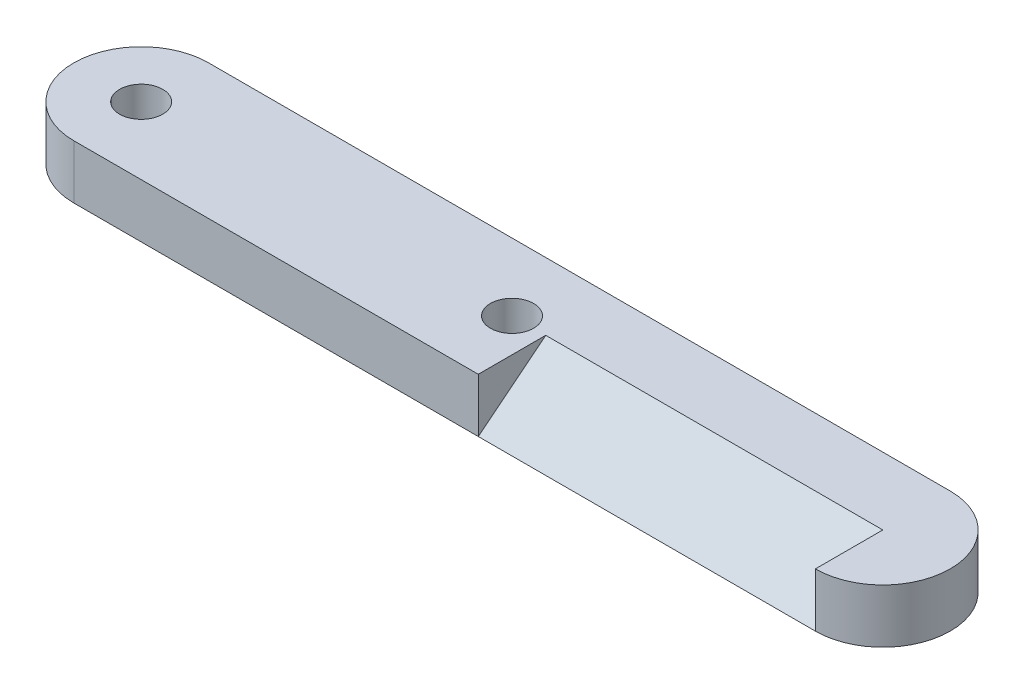
ISO-10303-21;
HEADER;
FILE_DESCRIPTION(('STEP AP214'),'2;1');
FILE_NAME('part.step','',(''),(''),'','','');
FILE_SCHEMA(('AUTOMOTIVE_DESIGN { 1 0 10303 214 1 1 1 1 }'));
ENDSEC;
DATA;
#1=APPLICATION_CONTEXT('core data for automotive mechanical design processes');
#2=APPLICATION_PROTOCOL_DEFINITION('international standard','automotive_design',2000,#1);
#3=PRODUCT_CONTEXT('',#1,'mechanical');
#4=PRODUCT('Part','Part','',(#3));
#5=PRODUCT_RELATED_PRODUCT_CATEGORY('part','',(#4));
#6=PRODUCT_DEFINITION_FORMATION('','',#4);
#7=PRODUCT_DEFINITION_CONTEXT('part definition',#1,'design');
#8=PRODUCT_DEFINITION('design','',#6,#7);
#9=PRODUCT_DEFINITION_SHAPE('','',#8);
#10=(LENGTH_UNIT() NAMED_UNIT(*) SI_UNIT(.MILLI.,.METRE.));
#11=(NAMED_UNIT(*) PLANE_ANGLE_UNIT() SI_UNIT($,.RADIAN.));
#12=(NAMED_UNIT(*) SI_UNIT($,.STERADIAN.) SOLID_ANGLE_UNIT());
#13=UNCERTAINTY_MEASURE_WITH_UNIT(LENGTH_MEASURE(1.E-05),#10,'distance_accuracy_value','');
#14=(GEOMETRIC_REPRESENTATION_CONTEXT(3) GLOBAL_UNCERTAINTY_ASSIGNED_CONTEXT((#13)) GLOBAL_UNIT_ASSIGNED_CONTEXT((#10,
#11,#12)) REPRESENTATION_CONTEXT('',''));
#15=CARTESIAN_POINT('',(0.,0.,0.));
#16=DIRECTION('',(0.,0.,1.));
#17=DIRECTION('',(1.,0.,0.));
#18=AXIS2_PLACEMENT_3D('',#15,#16,#17);
#19=CARTESIAN_POINT('',(55.,4.,0.));
#20=DIRECTION('',(1.,0.,0.));
#21=DIRECTION('',(0.,0.,-1.));
#22=AXIS2_PLACEMENT_3D('',#19,#20,#21);
#23=PLANE('',#22);
#24=DIRECTION('',(0.,-0.624695047554424,0.78086880944303));
#25=VECTOR('',#24,1.);
#26=CARTESIAN_POINT('',(55.,4.,0.));
#27=LINE('',#26,#25);
#28=CARTESIAN_POINT('',(55.,4.,0.));
#29=VERTEX_POINT('',#28);
#30=CARTESIAN_POINT('',(55.,0.,5.));
#31=VERTEX_POINT('',#30);
#32=EDGE_CURVE('E104',#29,#31,#27,.T.);
#33=ORIENTED_EDGE('',*,*,#32,.T.);
#34=DIRECTION('',(0.,-1.,0.));
#35=VECTOR('',#34,1.);
#36=CARTESIAN_POINT('',(55.,4.,5.));
#37=LINE('',#36,#35);
#38=CARTESIAN_POINT('',(55.,4.,5.));
#39=VERTEX_POINT('',#38);
#40=EDGE_CURVE('E47',#39,#31,#37,.T.);
#41=ORIENTED_EDGE('',*,*,#40,.F.);
#42=DIRECTION('',(0.,0.,1.));
#43=VECTOR('',#42,1.);
#44=CARTESIAN_POINT('',(55.,4.,0.));
#45=LINE('',#44,#43);
#46=EDGE_CURVE('E101',#29,#39,#45,.T.);
#47=ORIENTED_EDGE('',*,*,#46,.F.);
#48=EDGE_LOOP('',(#33,#41,#47));
#49=FACE_BOUND('',#48,.T.);
#50=ADVANCED_FACE('F38',(#49),#23,.F.);
#51=CARTESIAN_POINT('',(30.,4.,0.));
#52=DIRECTION('',(-1.,0.,0.));
#53=DIRECTION('',(0.,0.,1.));
#54=AXIS2_PLACEMENT_3D('',#51,#52,#53);
#55=PLANE('',#54);
#56=DIRECTION('',(0.,-0.624695047554424,0.78086880944303));
#57=VECTOR('',#56,1.);
#58=CARTESIAN_POINT('',(30.,4.,0.));
#59=LINE('',#58,#57);
#60=CARTESIAN_POINT('',(30.,4.,0.));
#61=VERTEX_POINT('',#60);
#62=CARTESIAN_POINT('',(30.,0.,5.));
#63=VERTEX_POINT('',#62);
#64=EDGE_CURVE('E121',#61,#63,#59,.T.);
#65=ORIENTED_EDGE('',*,*,#64,.F.);
#66=DIRECTION('',(0.,0.,1.));
#67=VECTOR('',#66,1.);
#68=CARTESIAN_POINT('',(30.,4.,0.));
#69=LINE('',#68,#67);
#70=CARTESIAN_POINT('',(30.,4.,5.));
#71=VERTEX_POINT('',#70);
#72=EDGE_CURVE('E106',#61,#71,#69,.T.);
#73=ORIENTED_EDGE('',*,*,#72,.T.);
#74=DIRECTION('',(0.,-1.,0.));
#75=VECTOR('',#74,1.);
#76=CARTESIAN_POINT('',(30.,4.,5.));
#77=LINE('',#76,#75);
#78=EDGE_CURVE('E115',#71,#63,#77,.T.);
#79=ORIENTED_EDGE('',*,*,#78,.T.);
#80=EDGE_LOOP('',(#65,#73,#79));
#81=FACE_BOUND('',#80,.T.);
#82=ADVANCED_FACE('F177',(#81),#55,.F.);
#83=CARTESIAN_POINT('',(0.,4.,0.));
#84=DIRECTION('',(0.,-1.,0.));
#85=DIRECTION('',(0.,0.,-1.));
#86=AXIS2_PLACEMENT_3D('',#83,#84,#85);
#87=CYLINDRICAL_SURFACE('',#86,5.);
#88=CARTESIAN_POINT('',(0.,0.,0.));
#89=DIRECTION('',(0.,1.,0.));
#90=DIRECTION('',(0.,0.,1.));
#91=AXIS2_PLACEMENT_3D('',#88,#89,#90);
#92=CIRCLE('',#91,5.);
#93=CARTESIAN_POINT('',(0.,0.,-5.));
#94=VERTEX_POINT('',#93);
#95=CARTESIAN_POINT('',(0.,0.,5.));
#96=VERTEX_POINT('',#95);
#97=EDGE_CURVE('E132',#94,#96,#92,.T.);
#98=ORIENTED_EDGE('',*,*,#97,.T.);
#99=DIRECTION('',(0.,-1.,0.));
#100=VECTOR('',#99,1.);
#101=CARTESIAN_POINT('',(0.,4.,5.));
#102=LINE('',#101,#100);
#103=CARTESIAN_POINT('',(0.,4.,5.));
#104=VERTEX_POINT('',#103);
#105=EDGE_CURVE('E11',#104,#96,#102,.T.);
#106=ORIENTED_EDGE('',*,*,#105,.F.);
#107=CARTESIAN_POINT('',(0.,4.,0.));
#108=DIRECTION('',(0.,1.,0.));
#109=DIRECTION('',(0.,0.,1.));
#110=AXIS2_PLACEMENT_3D('',#107,#108,#109);
#111=CIRCLE('',#110,5.);
#112=CARTESIAN_POINT('',(0.,4.,-5.));
#113=VERTEX_POINT('',#112);
#114=EDGE_CURVE('E141',#113,#104,#111,.T.);
#115=ORIENTED_EDGE('',*,*,#114,.F.);
#116=DIRECTION('',(0.,-1.,0.));
#117=VECTOR('',#116,1.);
#118=CARTESIAN_POINT('',(0.,4.,-5.));
#119=LINE('',#118,#117);
#120=EDGE_CURVE('E147',#113,#94,#119,.T.);
#121=ORIENTED_EDGE('',*,*,#120,.T.);
#122=EDGE_LOOP('',(#98,#106,#115,#121));
#123=FACE_BOUND('',#122,.T.);
#124=ADVANCED_FACE('F40',(#123),#87,.T.);
#125=CARTESIAN_POINT('',(0.,4.,5.));
#126=DIRECTION('',(0.,0.,-1.));
#127=DIRECTION('',(-1.,0.,0.));
#128=AXIS2_PLACEMENT_3D('',#125,#126,#127);
#129=PLANE('',#128);
#130=DIRECTION('',(1.,0.,0.));
#131=VECTOR('',#130,1.);
#132=CARTESIAN_POINT('',(0.,0.,5.));
#133=LINE('',#132,#131);
#134=EDGE_CURVE('E150',#96,#63,#133,.T.);
#135=ORIENTED_EDGE('',*,*,#134,.T.);
#136=ORIENTED_EDGE('',*,*,#78,.F.);
#137=DIRECTION('',(1.,0.,0.));
#138=VECTOR('',#137,1.);
#139=CARTESIAN_POINT('',(0.,4.,5.));
#140=LINE('',#139,#138);
#141=EDGE_CURVE('E81',#104,#71,#140,.T.);
#142=ORIENTED_EDGE('',*,*,#141,.F.);
#143=ORIENTED_EDGE('',*,*,#105,.T.);
#144=EDGE_LOOP('',(#135,#136,#142,#143));
#145=FACE_BOUND('',#144,.T.);
#146=ADVANCED_FACE('F173',(#145),#129,.F.);
#147=CARTESIAN_POINT('',(55.,4.,0.));
#148=DIRECTION('',(0.,-1.,0.));
#149=DIRECTION('',(0.,0.,-1.));
#150=AXIS2_PLACEMENT_3D('',#147,#148,#149);
#151=CYLINDRICAL_SURFACE('',#150,5.);
#152=CARTESIAN_POINT('',(55.,0.,0.));
#153=DIRECTION('',(0.,1.,0.));
#154=DIRECTION('',(0.,0.,1.));
#155=AXIS2_PLACEMENT_3D('',#152,#153,#154);
#156=CIRCLE('',#155,5.);
#157=CARTESIAN_POINT('',(55.,0.,-5.));
#158=VERTEX_POINT('',#157);
#159=EDGE_CURVE('E70',#31,#158,#156,.T.);
#160=ORIENTED_EDGE('',*,*,#159,.T.);
#161=DIRECTION('',(0.,-1.,0.));
#162=VECTOR('',#161,1.);
#163=CARTESIAN_POINT('',(55.,4.,-5.));
#164=LINE('',#163,#162);
#165=CARTESIAN_POINT('',(55.,4.,-5.));
#166=VERTEX_POINT('',#165);
#167=EDGE_CURVE('E156',#166,#158,#164,.T.);
#168=ORIENTED_EDGE('',*,*,#167,.F.);
#169=CARTESIAN_POINT('',(55.,4.,0.));
#170=DIRECTION('',(0.,1.,0.));
#171=DIRECTION('',(0.,0.,1.));
#172=AXIS2_PLACEMENT_3D('',#169,#170,#171);
#173=CIRCLE('',#172,5.);
#174=EDGE_CURVE('E144',#39,#166,#173,.T.);
#175=ORIENTED_EDGE('',*,*,#174,.F.);
#176=ORIENTED_EDGE('',*,*,#40,.T.);
#177=EDGE_LOOP('',(#160,#168,#175,#176));
#178=FACE_BOUND('',#177,.T.);
#179=ADVANCED_FACE('F157',(#178),#151,.T.);
#180=CARTESIAN_POINT('',(0.,4.,-5.));
#181=DIRECTION('',(0.,0.,1.));
#182=DIRECTION('',(1.,0.,0.));
#183=AXIS2_PLACEMENT_3D('',#180,#181,#182);
#184=PLANE('',#183);
#185=DIRECTION('',(-1.,0.,0.));
#186=VECTOR('',#185,1.);
#187=CARTESIAN_POINT('',(0.,0.,-5.));
#188=LINE('',#187,#186);
#189=EDGE_CURVE('E75',#158,#94,#188,.T.);
#190=ORIENTED_EDGE('',*,*,#189,.T.);
#191=ORIENTED_EDGE('',*,*,#120,.F.);
#192=DIRECTION('',(-1.,0.,0.));
#193=VECTOR('',#192,1.);
#194=CARTESIAN_POINT('',(0.,4.,-5.));
#195=LINE('',#194,#193);
#196=EDGE_CURVE('E55',#166,#113,#195,.T.);
#197=ORIENTED_EDGE('',*,*,#196,.F.);
#198=ORIENTED_EDGE('',*,*,#167,.T.);
#199=EDGE_LOOP('',(#190,#191,#197,#198));
#200=FACE_BOUND('',#199,.T.);
#201=ADVANCED_FACE('F165',(#200),#184,.F.);
#202=CARTESIAN_POINT('',(0.,4.,0.));
#203=DIRECTION('',(0.,1.,0.));
#204=DIRECTION('',(0.,0.,1.));
#205=AXIS2_PLACEMENT_3D('',#202,#203,#204);
#206=PLANE('',#205);
#207=ORIENTED_EDGE('',*,*,#46,.T.);
#208=ORIENTED_EDGE('',*,*,#174,.T.);
#209=ORIENTED_EDGE('',*,*,#196,.T.);
#210=ORIENTED_EDGE('',*,*,#114,.T.);
#211=ORIENTED_EDGE('',*,*,#141,.T.);
#212=ORIENTED_EDGE('',*,*,#72,.F.);
#213=DIRECTION('',(-1.,0.,0.));
#214=VECTOR('',#213,1.);
#215=CARTESIAN_POINT('',(55.,4.,0.));
#216=LINE('',#215,#214);
#217=EDGE_CURVE('E107',#29,#61,#216,.T.);
#218=ORIENTED_EDGE('',*,*,#217,.F.);
#219=EDGE_LOOP('',(#207,#208,#209,#210,#211,#212,#218));
#220=FACE_BOUND('',#219,.T.);
#221=CARTESIAN_POINT('',(0.,4.,0.));
#222=DIRECTION('',(0.,1.,0.));
#223=DIRECTION('',(0.,0.,1.));
#224=AXIS2_PLACEMENT_3D('',#221,#222,#223);
#225=CIRCLE('',#224,1.6);
#226=CARTESIAN_POINT('',(0.,4.,1.6));
#227=VERTEX_POINT('',#226);
#228=EDGE_CURVE('E133',#227,#227,#225,.T.);
#229=ORIENTED_EDGE('',*,*,#228,.F.);
#230=EDGE_LOOP('',(#229));
#231=FACE_BOUND('',#230,.T.);
#232=CARTESIAN_POINT('',(27.5,4.,0.));
#233=DIRECTION('',(0.,1.,0.));
#234=DIRECTION('',(0.,0.,1.));
#235=AXIS2_PLACEMENT_3D('',#232,#233,#234);
#236=CIRCLE('',#235,1.6);
#237=CARTESIAN_POINT('',(27.5,4.,1.6));
#238=VERTEX_POINT('',#237);
#239=EDGE_CURVE('E127',#238,#238,#236,.T.);
#240=ORIENTED_EDGE('',*,*,#239,.F.);
#241=EDGE_LOOP('',(#240));
#242=FACE_BOUND('',#241,.T.);
#243=ADVANCED_FACE('F111',(#220,#231,#242),#206,.T.);
#244=CARTESIAN_POINT('',(0.,0.,0.));
#245=DIRECTION('',(0.,1.,0.));
#246=DIRECTION('',(0.,0.,1.));
#247=AXIS2_PLACEMENT_3D('',#244,#245,#246);
#248=PLANE('',#247);
#249=ORIENTED_EDGE('',*,*,#159,.F.);
#250=DIRECTION('',(-1.,0.,0.));
#251=VECTOR('',#250,1.);
#252=CARTESIAN_POINT('',(55.,0.,5.));
#253=LINE('',#252,#251);
#254=EDGE_CURVE('E120',#31,#63,#253,.T.);
#255=ORIENTED_EDGE('',*,*,#254,.T.);
#256=ORIENTED_EDGE('',*,*,#134,.F.);
#257=ORIENTED_EDGE('',*,*,#97,.F.);
#258=ORIENTED_EDGE('',*,*,#189,.F.);
#259=EDGE_LOOP('',(#249,#255,#256,#257,#258));
#260=FACE_BOUND('',#259,.T.);
#261=CARTESIAN_POINT('',(0.,0.,0.));
#262=DIRECTION('',(0.,1.,0.));
#263=DIRECTION('',(0.,0.,1.));
#264=AXIS2_PLACEMENT_3D('',#261,#262,#263);
#265=CIRCLE('',#264,1.6);
#266=CARTESIAN_POINT('',(0.,0.,1.6));
#267=VERTEX_POINT('',#266);
#268=EDGE_CURVE('E129',#267,#267,#265,.T.);
#269=ORIENTED_EDGE('',*,*,#268,.T.);
#270=EDGE_LOOP('',(#269));
#271=FACE_BOUND('',#270,.T.);
#272=CARTESIAN_POINT('',(27.5,0.,0.));
#273=DIRECTION('',(0.,1.,0.));
#274=DIRECTION('',(0.,0.,1.));
#275=AXIS2_PLACEMENT_3D('',#272,#273,#274);
#276=CIRCLE('',#275,1.6);
#277=CARTESIAN_POINT('',(27.5,0.,1.6));
#278=VERTEX_POINT('',#277);
#279=EDGE_CURVE('E136',#278,#278,#276,.T.);
#280=ORIENTED_EDGE('',*,*,#279,.T.);
#281=EDGE_LOOP('',(#280));
#282=FACE_BOUND('',#281,.T.);
#283=ADVANCED_FACE('F159',(#260,#271,#282),#248,.F.);
#284=CARTESIAN_POINT('',(27.5,0.,0.));
#285=DIRECTION('',(0.,1.,0.));
#286=DIRECTION('',(0.,0.,1.));
#287=AXIS2_PLACEMENT_3D('',#284,#285,#286);
#288=CYLINDRICAL_SURFACE('',#287,1.6);
#289=ORIENTED_EDGE('',*,*,#279,.F.);
#290=EDGE_LOOP('',(#289));
#291=FACE_BOUND('',#290,.T.);
#292=ORIENTED_EDGE('',*,*,#239,.T.);
#293=EDGE_LOOP('',(#292));
#294=FACE_BOUND('',#293,.T.);
#295=ADVANCED_FACE('F189',(#291,#294),#288,.F.);
#296=CARTESIAN_POINT('',(0.,0.,0.));
#297=DIRECTION('',(0.,1.,0.));
#298=DIRECTION('',(0.,0.,1.));
#299=AXIS2_PLACEMENT_3D('',#296,#297,#298);
#300=CYLINDRICAL_SURFACE('',#299,1.6);
#301=ORIENTED_EDGE('',*,*,#268,.F.);
#302=EDGE_LOOP('',(#301));
#303=FACE_BOUND('',#302,.T.);
#304=ORIENTED_EDGE('',*,*,#228,.T.);
#305=EDGE_LOOP('',(#304));
#306=FACE_BOUND('',#305,.T.);
#307=ADVANCED_FACE('F186',(#303,#306),#300,.F.);
#308=CARTESIAN_POINT('',(55.,4.,0.));
#309=DIRECTION('',(0.,-0.78086880944303,-0.624695047554424));
#310=DIRECTION('',(0.,0.624695047554424,-0.78086880944303));
#311=AXIS2_PLACEMENT_3D('',#308,#309,#310);
#312=PLANE('',#311);
#313=ORIENTED_EDGE('',*,*,#64,.T.);
#314=ORIENTED_EDGE('',*,*,#254,.F.);
#315=ORIENTED_EDGE('',*,*,#32,.F.);
#316=ORIENTED_EDGE('',*,*,#217,.T.);
#317=EDGE_LOOP('',(#313,#314,#315,#316));
#318=FACE_BOUND('',#317,.T.);
#319=ADVANCED_FACE('F118',(#318),#312,.F.);
#320=CLOSED_SHELL('',(#50,#82,#124,#146,#179,#201,#243,#283,#295,#307,#319));
#321=MANIFOLD_SOLID_BREP('B2',#320);
#322=ADVANCED_BREP_SHAPE_REPRESENTATION('',(#18,#321),#14);
#323=SHAPE_DEFINITION_REPRESENTATION(#9,#322);
ENDSEC;
END-ISO-10303-21;
